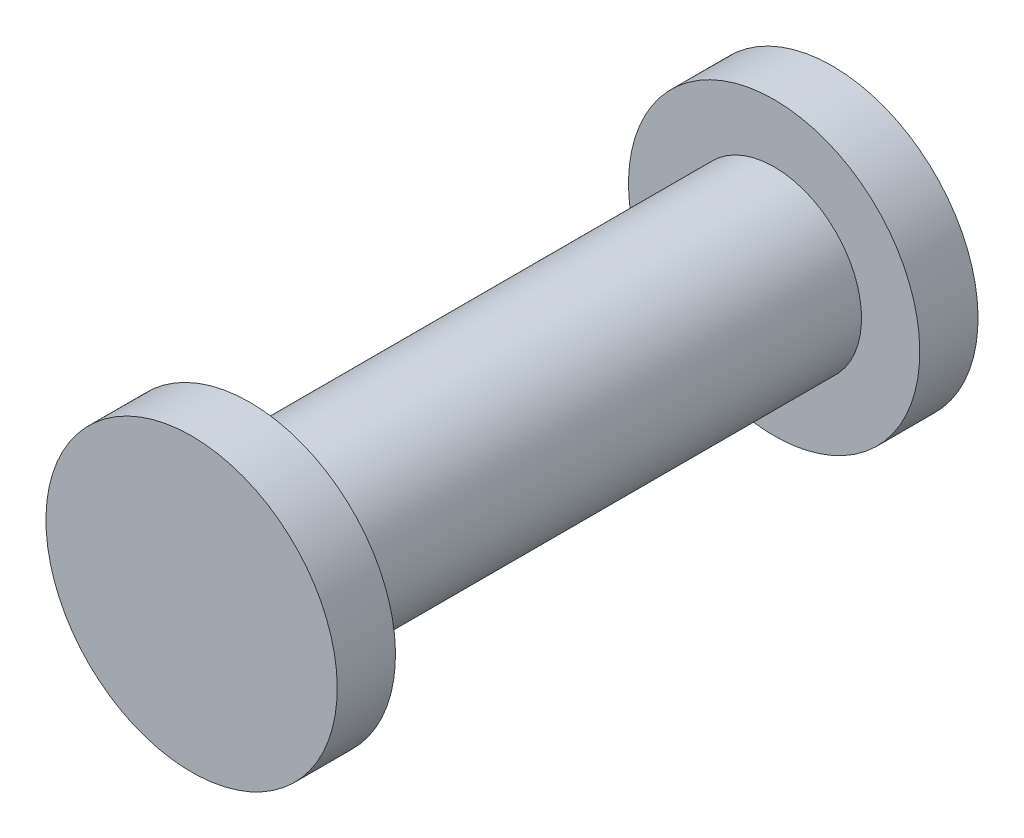
ISO-10303-21;
HEADER;
FILE_DESCRIPTION(('STEP AP214'),'2;1');
FILE_NAME('part.step','',(''),(''),'','','');
FILE_SCHEMA(('AUTOMOTIVE_DESIGN { 1 0 10303 214 1 1 1 1 }'));
ENDSEC;
DATA;
#1=APPLICATION_CONTEXT('core data for automotive mechanical design processes');
#2=APPLICATION_PROTOCOL_DEFINITION('international standard','automotive_design',2000,#1);
#3=PRODUCT_CONTEXT('',#1,'mechanical');
#4=PRODUCT('Part','Part','',(#3));
#5=PRODUCT_RELATED_PRODUCT_CATEGORY('part','',(#4));
#6=PRODUCT_DEFINITION_FORMATION('','',#4);
#7=PRODUCT_DEFINITION_CONTEXT('part definition',#1,'design');
#8=PRODUCT_DEFINITION('design','',#6,#7);
#9=PRODUCT_DEFINITION_SHAPE('','',#8);
#10=(LENGTH_UNIT() NAMED_UNIT(*) SI_UNIT(.MILLI.,.METRE.));
#11=(NAMED_UNIT(*) PLANE_ANGLE_UNIT() SI_UNIT($,.RADIAN.));
#12=(NAMED_UNIT(*) SI_UNIT($,.STERADIAN.) SOLID_ANGLE_UNIT());
#13=UNCERTAINTY_MEASURE_WITH_UNIT(LENGTH_MEASURE(1.E-05),#10,'distance_accuracy_value','');
#14=(GEOMETRIC_REPRESENTATION_CONTEXT(3) GLOBAL_UNCERTAINTY_ASSIGNED_CONTEXT((#13)) GLOBAL_UNIT_ASSIGNED_CONTEXT((#10,
#11,#12)) REPRESENTATION_CONTEXT('',''));
#15=CARTESIAN_POINT('',(0.,0.,0.));
#16=DIRECTION('',(0.,0.,1.));
#17=DIRECTION('',(1.,0.,0.));
#18=AXIS2_PLACEMENT_3D('',#15,#16,#17);
#19=CARTESIAN_POINT('',(-5.23982460190989,57.9999999999997,-3.499999999999));
#20=DIRECTION('',(0.,0.,-1.));
#21=DIRECTION('',(-0.555467218879167,0.831538434920866,0.));
#22=AXIS2_PLACEMENT_3D('',#19,#20,#21);
#23=CYLINDRICAL_SURFACE('',#22,2.49999999999996);
#24=CARTESIAN_POINT('',(-5.23982460190989,57.9999999999997,-3.999999999999));
#25=DIRECTION('',(0.,0.,-1.));
#26=DIRECTION('',(0.831538434920866,0.555467218879167,0.));
#27=AXIS2_PLACEMENT_3D('',#24,#25,#26);
#28=CIRCLE('',#27,2.49999999999996);
#29=CARTESIAN_POINT('',(-3.85115655471203,55.9211539126976,-3.999999999999));
#30=VERTEX_POINT('',#29);
#31=EDGE_CURVE('E55',#30,#30,#28,.T.);
#32=ORIENTED_EDGE('',*,*,#31,.F.);
#33=DIRECTION('',(0.,0.,1.));
#34=VECTOR('',#33,1.);
#35=CARTESIAN_POINT('',(-3.85115655471203,55.9211539126976,-3.499999999999));
#36=LINE('',#35,#34);
#37=CARTESIAN_POINT('',(-3.85115655471203,55.9211539126976,-2.999999999999));
#38=VERTEX_POINT('',#37);
#39=EDGE_CURVE('E11',#30,#38,#36,.T.);
#40=ORIENTED_EDGE('',*,*,#39,.T.);
#41=CARTESIAN_POINT('',(-5.23982460190989,57.9999999999997,-2.999999999999));
#42=DIRECTION('',(0.,0.,-1.));
#43=DIRECTION('',(0.831538434920866,0.555467218879167,0.));
#44=AXIS2_PLACEMENT_3D('',#41,#42,#43);
#45=CIRCLE('',#44,2.49999999999996);
#46=EDGE_CURVE('E48',#38,#38,#45,.T.);
#47=ORIENTED_EDGE('',*,*,#46,.T.);
#48=ORIENTED_EDGE('',*,*,#39,.F.);
#49=EDGE_LOOP('',(#32,#40,#47,#48));
#50=FACE_BOUND('',#49,.T.);
#51=ADVANCED_FACE('F38',(#50),#23,.T.);
#52=CARTESIAN_POINT('',(-5.23982460190989,57.9999999999997,-3.999999999999));
#53=DIRECTION('',(0.,0.,-1.));
#54=DIRECTION('',(0.831538434920866,0.555467218879167,0.));
#55=AXIS2_PLACEMENT_3D('',#52,#53,#54);
#56=PLANE('',#55);
#57=ORIENTED_EDGE('',*,*,#31,.T.);
#58=EDGE_LOOP('',(#57));
#59=FACE_BOUND('',#58,.T.);
#60=ADVANCED_FACE('F40',(#59),#56,.T.);
#61=CARTESIAN_POINT('',(-6.62849264910782,60.0788460873019,7.000000000001));
#62=DIRECTION('',(0.,0.,1.));
#63=DIRECTION('',(0.555467218879167,-0.831538434920866,0.));
#64=AXIS2_PLACEMENT_3D('',#61,#62,#63);
#65=PLANE('',#64);
#66=CARTESIAN_POINT('',(-5.23982460190989,57.9999999999997,7.000000000001));
#67=DIRECTION('',(0.,0.,-1.));
#68=DIRECTION('',(0.831538434920866,0.555467218879167,0.));
#69=AXIS2_PLACEMENT_3D('',#66,#67,#68);
#70=CIRCLE('',#69,2.5);
#71=CARTESIAN_POINT('',(-3.85115655471198,55.9211539126976,7.000000000001));
#72=VERTEX_POINT('',#71);
#73=EDGE_CURVE('E84',#72,#72,#70,.T.);
#74=ORIENTED_EDGE('',*,*,#73,.F.);
#75=EDGE_LOOP('',(#74));
#76=FACE_BOUND('',#75,.T.);
#77=ADVANCED_FACE('F105',(#76),#65,.T.);
#78=CARTESIAN_POINT('',(-5.23982460190989,57.9999999999997,6.500000000001));
#79=DIRECTION('',(0.,0.,-1.));
#80=DIRECTION('',(-0.555467218879167,0.831538434920866,0.));
#81=AXIS2_PLACEMENT_3D('',#78,#79,#80);
#82=CYLINDRICAL_SURFACE('',#81,2.5);
#83=CARTESIAN_POINT('',(-5.23982460190989,57.9999999999997,6.000000000001));
#84=DIRECTION('',(0.,0.,-1.));
#85=DIRECTION('',(0.831538434920866,0.555467218879167,0.));
#86=AXIS2_PLACEMENT_3D('',#83,#84,#85);
#87=CIRCLE('',#86,2.5);
#88=CARTESIAN_POINT('',(-3.85115655471198,55.9211539126976,6.000000000001));
#89=VERTEX_POINT('',#88);
#90=EDGE_CURVE('E78',#89,#89,#87,.T.);
#91=ORIENTED_EDGE('',*,*,#90,.F.);
#92=DIRECTION('',(0.,0.,1.));
#93=VECTOR('',#92,1.);
#94=CARTESIAN_POINT('',(-3.85115655471198,55.9211539126976,6.500000000001));
#95=LINE('',#94,#93);
#96=EDGE_CURVE('E81',#89,#72,#95,.T.);
#97=ORIENTED_EDGE('',*,*,#96,.T.);
#98=ORIENTED_EDGE('',*,*,#73,.T.);
#99=ORIENTED_EDGE('',*,*,#96,.F.);
#100=EDGE_LOOP('',(#91,#97,#98,#99));
#101=FACE_BOUND('',#100,.T.);
#102=ADVANCED_FACE('F110',(#101),#82,.T.);
#103=CARTESIAN_POINT('',(-6.0730254302287,59.2473076523811,6.000000000001));
#104=DIRECTION('',(0.,0.,-1.));
#105=DIRECTION('',(0.831538434920866,0.555467218879167,0.));
#106=AXIS2_PLACEMENT_3D('',#103,#104,#105);
#107=PLANE('',#106);
#108=ORIENTED_EDGE('',*,*,#90,.T.);
#109=EDGE_LOOP('',(#108));
#110=FACE_BOUND('',#109,.T.);
#111=CARTESIAN_POINT('',(-5.23982460190989,57.9999999999997,6.000000000001));
#112=DIRECTION('',(0.,0.,-1.));
#113=DIRECTION('',(0.831538434920866,0.555467218879167,0.));
#114=AXIS2_PLACEMENT_3D('',#111,#112,#113);
#115=CIRCLE('',#114,1.50000000000003);
#116=CARTESIAN_POINT('',(-4.40662377359115,56.7526923476184,6.000000000001));
#117=VERTEX_POINT('',#116);
#118=EDGE_CURVE('E69',#117,#117,#115,.T.);
#119=ORIENTED_EDGE('',*,*,#118,.F.);
#120=EDGE_LOOP('',(#119));
#121=FACE_BOUND('',#120,.T.);
#122=ADVANCED_FACE('F97',(#110,#121),#107,.T.);
#123=CARTESIAN_POINT('',(-5.23982460190989,57.9999999999997,1.50000000000099));
#124=DIRECTION('',(0.,0.,-1.));
#125=DIRECTION('',(-0.555467218879167,0.831538434920866,0.));
#126=AXIS2_PLACEMENT_3D('',#123,#124,#125);
#127=CYLINDRICAL_SURFACE('',#126,1.5);
#128=CARTESIAN_POINT('',(-5.23982460190989,57.9999999999997,-2.999999999999));
#129=DIRECTION('',(0.,0.,-1.));
#130=DIRECTION('',(0.831538434920866,0.555467218879167,0.));
#131=AXIS2_PLACEMENT_3D('',#128,#129,#130);
#132=CIRCLE('',#131,1.5);
#133=CARTESIAN_POINT('',(-4.40662377359115,56.7526923476184,-2.999999999999));
#134=VERTEX_POINT('',#133);
#135=EDGE_CURVE('E42',#134,#134,#132,.T.);
#136=ORIENTED_EDGE('',*,*,#135,.F.);
#137=DIRECTION('',(0.,0.,1.));
#138=VECTOR('',#137,1.);
#139=CARTESIAN_POINT('',(-4.40662377359115,56.7526923476184,1.50000000000099));
#140=LINE('',#139,#138);
#141=EDGE_CURVE('E76',#134,#117,#140,.T.);
#142=ORIENTED_EDGE('',*,*,#141,.T.);
#143=ORIENTED_EDGE('',*,*,#118,.T.);
#144=ORIENTED_EDGE('',*,*,#141,.F.);
#145=EDGE_LOOP('',(#136,#142,#143,#144));
#146=FACE_BOUND('',#145,.T.);
#147=ADVANCED_FACE('F75',(#146),#127,.T.);
#148=CARTESIAN_POINT('',(-6.62849264910782,60.0788460873019,-2.999999999999));
#149=DIRECTION('',(0.,0.,1.));
#150=DIRECTION('',(0.555467218879167,-0.831538434920866,0.));
#151=AXIS2_PLACEMENT_3D('',#148,#149,#150);
#152=PLANE('',#151);
#153=ORIENTED_EDGE('',*,*,#46,.F.);
#154=EDGE_LOOP('',(#153));
#155=FACE_BOUND('',#154,.T.);
#156=ORIENTED_EDGE('',*,*,#135,.T.);
#157=EDGE_LOOP('',(#156));
#158=FACE_BOUND('',#157,.T.);
#159=ADVANCED_FACE('F92',(#155,#158),#152,.T.);
#160=CLOSED_SHELL('',(#51,#60,#77,#102,#122,#147,#159));
#161=MANIFOLD_SOLID_BREP('B2',#160);
#162=ADVANCED_BREP_SHAPE_REPRESENTATION('',(#18,#161),#14);
#163=SHAPE_DEFINITION_REPRESENTATION(#9,#162);
ENDSEC;
END-ISO-10303-21;
